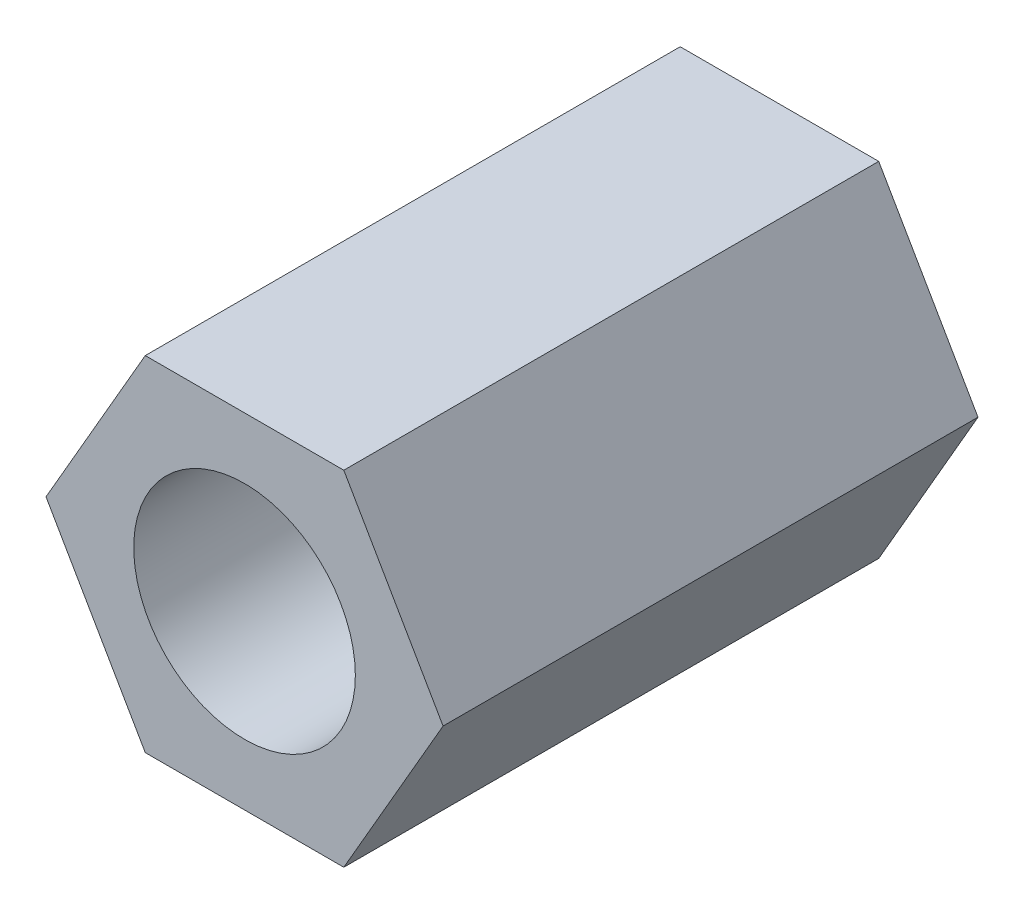
ISO-10303-21;
HEADER;
FILE_DESCRIPTION(('STEP AP214'),'2;1');
FILE_NAME('part.step','',(''),(''),'','','');
FILE_SCHEMA(('AUTOMOTIVE_DESIGN { 1 0 10303 214 1 1 1 1 }'));
ENDSEC;
DATA;
#1=APPLICATION_CONTEXT('core data for automotive mechanical design processes');
#2=APPLICATION_PROTOCOL_DEFINITION('international standard','automotive_design',2000,#1);
#3=PRODUCT_CONTEXT('',#1,'mechanical');
#4=PRODUCT('Part','Part','',(#3));
#5=PRODUCT_RELATED_PRODUCT_CATEGORY('part','',(#4));
#6=PRODUCT_DEFINITION_FORMATION('','',#4);
#7=PRODUCT_DEFINITION_CONTEXT('part definition',#1,'design');
#8=PRODUCT_DEFINITION('design','',#6,#7);
#9=PRODUCT_DEFINITION_SHAPE('','',#8);
#10=(LENGTH_UNIT() NAMED_UNIT(*) SI_UNIT(.MILLI.,.METRE.));
#11=(NAMED_UNIT(*) PLANE_ANGLE_UNIT() SI_UNIT($,.RADIAN.));
#12=(NAMED_UNIT(*) SI_UNIT($,.STERADIAN.) SOLID_ANGLE_UNIT());
#13=UNCERTAINTY_MEASURE_WITH_UNIT(LENGTH_MEASURE(1.E-05),#10,'distance_accuracy_value','');
#14=(GEOMETRIC_REPRESENTATION_CONTEXT(3) GLOBAL_UNCERTAINTY_ASSIGNED_CONTEXT((#13)) GLOBAL_UNIT_ASSIGNED_CONTEXT((#10,
#11,#12)) REPRESENTATION_CONTEXT('',''));
#15=CARTESIAN_POINT('',(0.,0.,0.));
#16=DIRECTION('',(0.,0.,1.));
#17=DIRECTION('',(1.,0.,0.));
#18=AXIS2_PLACEMENT_3D('',#15,#16,#17);
#19=CARTESIAN_POINT('',(0.,0.,7.));
#20=DIRECTION('',(0.,0.,-1.));
#21=DIRECTION('',(-1.,0.,0.));
#22=AXIS2_PLACEMENT_3D('',#19,#20,#21);
#23=PLANE('',#22);
#24=DIRECTION('',(-0.499999999999998,0.86602540378444,0.));
#25=VECTOR('',#24,1.);
#26=CARTESIAN_POINT('',(2.59807621135331,0.,7.));
#27=LINE('',#26,#25);
#28=CARTESIAN_POINT('',(2.59807621135331,0.,7.));
#29=VERTEX_POINT('',#28);
#30=CARTESIAN_POINT('',(1.29903810567666,2.25,7.));
#31=VERTEX_POINT('',#30);
#32=EDGE_CURVE('E129',#29,#31,#27,.T.);
#33=ORIENTED_EDGE('',*,*,#32,.T.);
#34=DIRECTION('',(-1.,0.,0.));
#35=VECTOR('',#34,1.);
#36=CARTESIAN_POINT('',(-1.29903810567666,2.25,7.));
#37=LINE('',#36,#35);
#38=CARTESIAN_POINT('',(-1.29903810567666,2.25,7.));
#39=VERTEX_POINT('',#38);
#40=EDGE_CURVE('E87',#31,#39,#37,.T.);
#41=ORIENTED_EDGE('',*,*,#40,.T.);
#42=DIRECTION('',(-0.499999999999998,-0.86602540378444,0.));
#43=VECTOR('',#42,1.);
#44=CARTESIAN_POINT('',(-2.59807621135331,0.,7.));
#45=LINE('',#44,#43);
#46=CARTESIAN_POINT('',(-2.59807621135331,0.,7.));
#47=VERTEX_POINT('',#46);
#48=EDGE_CURVE('E100',#39,#47,#45,.T.);
#49=ORIENTED_EDGE('',*,*,#48,.T.);
#50=DIRECTION('',(0.499999999999998,-0.86602540378444,0.));
#51=VECTOR('',#50,1.);
#52=CARTESIAN_POINT('',(-2.59807621135331,0.,7.));
#53=LINE('',#52,#51);
#54=CARTESIAN_POINT('',(-1.29903810567666,-2.25,7.));
#55=VERTEX_POINT('',#54);
#56=EDGE_CURVE('E94',#47,#55,#53,.T.);
#57=ORIENTED_EDGE('',*,*,#56,.T.);
#58=DIRECTION('',(1.,0.,0.));
#59=VECTOR('',#58,1.);
#60=CARTESIAN_POINT('',(-1.29903810567666,-2.25,7.));
#61=LINE('',#60,#59);
#62=CARTESIAN_POINT('',(1.29903810567666,-2.25,7.));
#63=VERTEX_POINT('',#62);
#64=EDGE_CURVE('E98',#55,#63,#61,.T.);
#65=ORIENTED_EDGE('',*,*,#64,.T.);
#66=DIRECTION('',(0.499999999999998,0.86602540378444,0.));
#67=VECTOR('',#66,1.);
#68=CARTESIAN_POINT('',(1.29903810567666,-2.25,7.));
#69=LINE('',#68,#67);
#70=EDGE_CURVE('E50',#63,#29,#69,.T.);
#71=ORIENTED_EDGE('',*,*,#70,.T.);
#72=EDGE_LOOP('',(#33,#41,#49,#57,#65,#71));
#73=FACE_BOUND('',#72,.T.);
#74=CARTESIAN_POINT('',(0.,0.,7.));
#75=DIRECTION('',(0.,0.,1.));
#76=DIRECTION('',(1.,0.,0.));
#77=AXIS2_PLACEMENT_3D('',#74,#75,#76);
#78=CIRCLE('',#77,1.45);
#79=CARTESIAN_POINT('',(1.45,0.,7.));
#80=VERTEX_POINT('',#79);
#81=EDGE_CURVE('E122',#80,#80,#78,.T.);
#82=ORIENTED_EDGE('',*,*,#81,.F.);
#83=EDGE_LOOP('',(#82));
#84=FACE_BOUND('',#83,.T.);
#85=ADVANCED_FACE('F33',(#73,#84),#23,.F.);
#86=CARTESIAN_POINT('',(0.,0.,0.));
#87=DIRECTION('',(0.,0.,-1.));
#88=DIRECTION('',(-1.,0.,0.));
#89=AXIS2_PLACEMENT_3D('',#86,#87,#88);
#90=PLANE('',#89);
#91=DIRECTION('',(-0.499999999999998,0.86602540378444,0.));
#92=VECTOR('',#91,1.);
#93=CARTESIAN_POINT('',(2.59807621135331,0.,0.));
#94=LINE('',#93,#92);
#95=CARTESIAN_POINT('',(2.59807621135331,0.,0.));
#96=VERTEX_POINT('',#95);
#97=CARTESIAN_POINT('',(1.29903810567666,2.25,0.));
#98=VERTEX_POINT('',#97);
#99=EDGE_CURVE('E118',#96,#98,#94,.T.);
#100=ORIENTED_EDGE('',*,*,#99,.F.);
#101=DIRECTION('',(0.499999999999998,0.86602540378444,0.));
#102=VECTOR('',#101,1.);
#103=CARTESIAN_POINT('',(1.29903810567666,-2.25,0.));
#104=LINE('',#103,#102);
#105=CARTESIAN_POINT('',(1.29903810567666,-2.25,0.));
#106=VERTEX_POINT('',#105);
#107=EDGE_CURVE('E79',#106,#96,#104,.T.);
#108=ORIENTED_EDGE('',*,*,#107,.F.);
#109=DIRECTION('',(1.,0.,0.));
#110=VECTOR('',#109,1.);
#111=CARTESIAN_POINT('',(-1.29903810567666,-2.25,0.));
#112=LINE('',#111,#110);
#113=CARTESIAN_POINT('',(-1.29903810567666,-2.25,0.));
#114=VERTEX_POINT('',#113);
#115=EDGE_CURVE('E73',#114,#106,#112,.T.);
#116=ORIENTED_EDGE('',*,*,#115,.F.);
#117=DIRECTION('',(0.499999999999998,-0.86602540378444,0.));
#118=VECTOR('',#117,1.);
#119=CARTESIAN_POINT('',(-2.59807621135331,0.,0.));
#120=LINE('',#119,#118);
#121=CARTESIAN_POINT('',(-2.59807621135331,0.,0.));
#122=VERTEX_POINT('',#121);
#123=EDGE_CURVE('E108',#122,#114,#120,.T.);
#124=ORIENTED_EDGE('',*,*,#123,.F.);
#125=DIRECTION('',(-0.499999999999998,-0.86602540378444,0.));
#126=VECTOR('',#125,1.);
#127=CARTESIAN_POINT('',(-2.59807621135331,0.,0.));
#128=LINE('',#127,#126);
#129=CARTESIAN_POINT('',(-1.29903810567666,2.25,0.));
#130=VERTEX_POINT('',#129);
#131=EDGE_CURVE('E124',#130,#122,#128,.T.);
#132=ORIENTED_EDGE('',*,*,#131,.F.);
#133=DIRECTION('',(-1.,0.,0.));
#134=VECTOR('',#133,1.);
#135=CARTESIAN_POINT('',(-1.29903810567666,2.25,0.));
#136=LINE('',#135,#134);
#137=EDGE_CURVE('E121',#98,#130,#136,.T.);
#138=ORIENTED_EDGE('',*,*,#137,.F.);
#139=EDGE_LOOP('',(#100,#108,#116,#124,#132,#138));
#140=FACE_BOUND('',#139,.T.);
#141=CARTESIAN_POINT('',(0.,0.,0.));
#142=DIRECTION('',(0.,0.,1.));
#143=DIRECTION('',(1.,0.,0.));
#144=AXIS2_PLACEMENT_3D('',#141,#142,#143);
#145=CIRCLE('',#144,1.45);
#146=CARTESIAN_POINT('',(1.45,0.,0.));
#147=VERTEX_POINT('',#146);
#148=EDGE_CURVE('E222',#147,#147,#145,.T.);
#149=ORIENTED_EDGE('',*,*,#148,.T.);
#150=EDGE_LOOP('',(#149));
#151=FACE_BOUND('',#150,.T.);
#152=ADVANCED_FACE('F138',(#140,#151),#90,.T.);
#153=CARTESIAN_POINT('',(2.59807621135331,0.,7.));
#154=DIRECTION('',(-0.86602540378444,-0.499999999999998,0.));
#155=DIRECTION('',(0.499999999999998,-0.86602540378444,0.));
#156=AXIS2_PLACEMENT_3D('',#153,#154,#155);
#157=PLANE('',#156);
#158=ORIENTED_EDGE('',*,*,#99,.T.);
#159=DIRECTION('',(0.,0.,-1.));
#160=VECTOR('',#159,1.);
#161=CARTESIAN_POINT('',(1.29903810567666,2.25,7.));
#162=LINE('',#161,#160);
#163=EDGE_CURVE('E11',#31,#98,#162,.T.);
#164=ORIENTED_EDGE('',*,*,#163,.F.);
#165=ORIENTED_EDGE('',*,*,#32,.F.);
#166=DIRECTION('',(0.,0.,-1.));
#167=VECTOR('',#166,1.);
#168=CARTESIAN_POINT('',(2.59807621135331,0.,7.));
#169=LINE('',#168,#167);
#170=EDGE_CURVE('E114',#29,#96,#169,.T.);
#171=ORIENTED_EDGE('',*,*,#170,.T.);
#172=EDGE_LOOP('',(#158,#164,#165,#171));
#173=FACE_BOUND('',#172,.T.);
#174=ADVANCED_FACE('F35',(#173),#157,.F.);
#175=CARTESIAN_POINT('',(-1.29903810567666,2.25,7.));
#176=DIRECTION('',(0.,-1.,0.));
#177=DIRECTION('',(0.,0.,-1.));
#178=AXIS2_PLACEMENT_3D('',#175,#176,#177);
#179=PLANE('',#178);
#180=ORIENTED_EDGE('',*,*,#137,.T.);
#181=DIRECTION('',(0.,0.,-1.));
#182=VECTOR('',#181,1.);
#183=CARTESIAN_POINT('',(-1.29903810567666,2.25,7.));
#184=LINE('',#183,#182);
#185=EDGE_CURVE('E42',#39,#130,#184,.T.);
#186=ORIENTED_EDGE('',*,*,#185,.F.);
#187=ORIENTED_EDGE('',*,*,#40,.F.);
#188=ORIENTED_EDGE('',*,*,#163,.T.);
#189=EDGE_LOOP('',(#180,#186,#187,#188));
#190=FACE_BOUND('',#189,.T.);
#191=ADVANCED_FACE('F163',(#190),#179,.F.);
#192=CARTESIAN_POINT('',(-2.59807621135331,0.,7.));
#193=DIRECTION('',(0.86602540378444,-0.499999999999998,0.));
#194=DIRECTION('',(0.499999999999998,0.86602540378444,0.));
#195=AXIS2_PLACEMENT_3D('',#192,#193,#194);
#196=PLANE('',#195);
#197=ORIENTED_EDGE('',*,*,#131,.T.);
#198=DIRECTION('',(0.,0.,-1.));
#199=VECTOR('',#198,1.);
#200=CARTESIAN_POINT('',(-2.59807621135331,0.,7.));
#201=LINE('',#200,#199);
#202=EDGE_CURVE('E109',#47,#122,#201,.T.);
#203=ORIENTED_EDGE('',*,*,#202,.F.);
#204=ORIENTED_EDGE('',*,*,#48,.F.);
#205=ORIENTED_EDGE('',*,*,#185,.T.);
#206=EDGE_LOOP('',(#197,#203,#204,#205));
#207=FACE_BOUND('',#206,.T.);
#208=ADVANCED_FACE('F135',(#207),#196,.F.);
#209=CARTESIAN_POINT('',(-2.59807621135331,0.,7.));
#210=DIRECTION('',(0.86602540378444,0.499999999999998,0.));
#211=DIRECTION('',(-0.499999999999998,0.86602540378444,0.));
#212=AXIS2_PLACEMENT_3D('',#209,#210,#211);
#213=PLANE('',#212);
#214=ORIENTED_EDGE('',*,*,#123,.T.);
#215=DIRECTION('',(0.,0.,-1.));
#216=VECTOR('',#215,1.);
#217=CARTESIAN_POINT('',(-1.29903810567666,-2.25,7.));
#218=LINE('',#217,#216);
#219=EDGE_CURVE('E105',#55,#114,#218,.T.);
#220=ORIENTED_EDGE('',*,*,#219,.F.);
#221=ORIENTED_EDGE('',*,*,#56,.F.);
#222=ORIENTED_EDGE('',*,*,#202,.T.);
#223=EDGE_LOOP('',(#214,#220,#221,#222));
#224=FACE_BOUND('',#223,.T.);
#225=ADVANCED_FACE('F106',(#224),#213,.F.);
#226=CARTESIAN_POINT('',(-1.29903810567666,-2.25,7.));
#227=DIRECTION('',(0.,1.,0.));
#228=DIRECTION('',(-1.,0.,0.));
#229=AXIS2_PLACEMENT_3D('',#226,#227,#228);
#230=PLANE('',#229);
#231=ORIENTED_EDGE('',*,*,#115,.T.);
#232=DIRECTION('',(0.,0.,-1.));
#233=VECTOR('',#232,1.);
#234=CARTESIAN_POINT('',(1.29903810567666,-2.25,7.));
#235=LINE('',#234,#233);
#236=EDGE_CURVE('E110',#63,#106,#235,.T.);
#237=ORIENTED_EDGE('',*,*,#236,.F.);
#238=ORIENTED_EDGE('',*,*,#64,.F.);
#239=ORIENTED_EDGE('',*,*,#219,.T.);
#240=EDGE_LOOP('',(#231,#237,#238,#239));
#241=FACE_BOUND('',#240,.T.);
#242=ADVANCED_FACE('F112',(#241),#230,.F.);
#243=CARTESIAN_POINT('',(1.29903810567666,-2.25,7.));
#244=DIRECTION('',(-0.86602540378444,0.499999999999998,0.));
#245=DIRECTION('',(-0.499999999999998,-0.86602540378444,0.));
#246=AXIS2_PLACEMENT_3D('',#243,#244,#245);
#247=PLANE('',#246);
#248=ORIENTED_EDGE('',*,*,#107,.T.);
#249=ORIENTED_EDGE('',*,*,#170,.F.);
#250=ORIENTED_EDGE('',*,*,#70,.F.);
#251=ORIENTED_EDGE('',*,*,#236,.T.);
#252=EDGE_LOOP('',(#248,#249,#250,#251));
#253=FACE_BOUND('',#252,.T.);
#254=ADVANCED_FACE('F143',(#253),#247,.F.);
#255=CARTESIAN_POINT('',(0.,0.,7.));
#256=DIRECTION('',(0.,0.,-1.));
#257=DIRECTION('',(-1.,0.,0.));
#258=AXIS2_PLACEMENT_3D('',#255,#256,#257);
#259=CYLINDRICAL_SURFACE('',#258,1.45);
#260=ORIENTED_EDGE('',*,*,#81,.T.);
#261=EDGE_LOOP('',(#260));
#262=FACE_BOUND('',#261,.T.);
#263=ORIENTED_EDGE('',*,*,#148,.F.);
#264=EDGE_LOOP('',(#263));
#265=FACE_BOUND('',#264,.T.);
#266=ADVANCED_FACE('F145',(#262,#265),#259,.F.);
#267=CLOSED_SHELL('',(#85,#152,#174,#191,#208,#225,#242,#254,#266));
#268=MANIFOLD_SOLID_BREP('B2',#267);
#269=ADVANCED_BREP_SHAPE_REPRESENTATION('',(#18,#268),#14);
#270=SHAPE_DEFINITION_REPRESENTATION(#9,#269);
ENDSEC;
END-ISO-10303-21;
